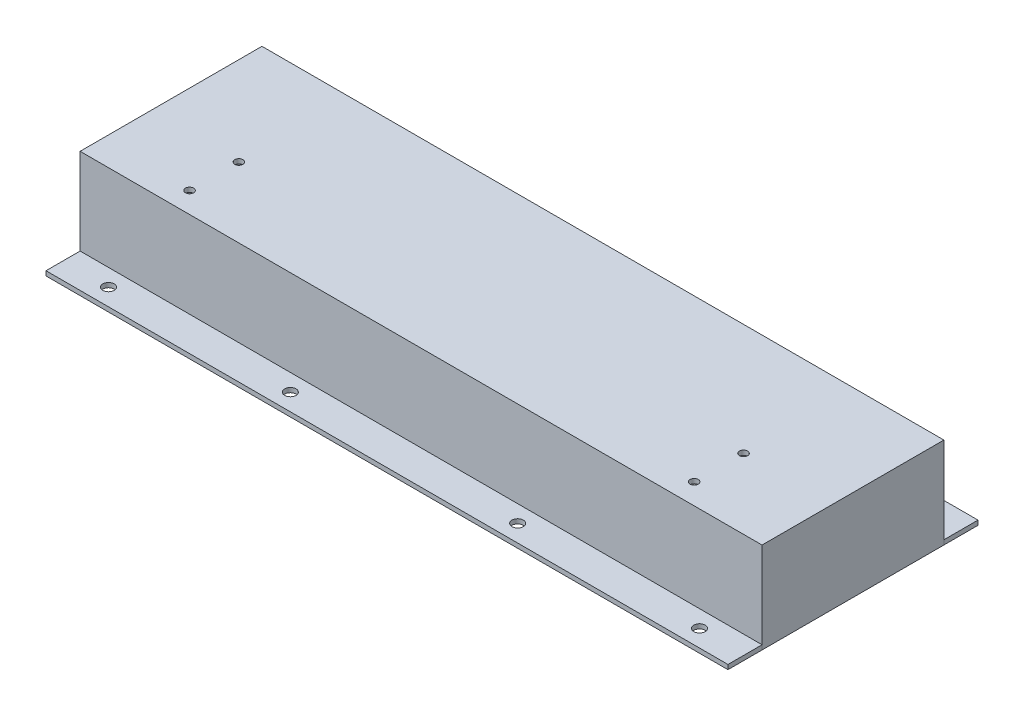
ISO-10303-21;
HEADER;
FILE_DESCRIPTION(('STEP AP214'),'2;1');
FILE_NAME('part.step','',(''),(''),'','','');
FILE_SCHEMA(('AUTOMOTIVE_DESIGN { 1 0 10303 214 1 1 1 1 }'));
ENDSEC;
DATA;
#1=APPLICATION_CONTEXT('core data for automotive mechanical design processes');
#2=APPLICATION_PROTOCOL_DEFINITION('international standard','automotive_design',2000,#1);
#3=PRODUCT_CONTEXT('',#1,'mechanical');
#4=PRODUCT('Part','Part','',(#3));
#5=PRODUCT_RELATED_PRODUCT_CATEGORY('part','',(#4));
#6=PRODUCT_DEFINITION_FORMATION('','',#4);
#7=PRODUCT_DEFINITION_CONTEXT('part definition',#1,'design');
#8=PRODUCT_DEFINITION('design','',#6,#7);
#9=PRODUCT_DEFINITION_SHAPE('','',#8);
#10=(LENGTH_UNIT() NAMED_UNIT(*) SI_UNIT(.MILLI.,.METRE.));
#11=(NAMED_UNIT(*) PLANE_ANGLE_UNIT() SI_UNIT($,.RADIAN.));
#12=(NAMED_UNIT(*) SI_UNIT($,.STERADIAN.) SOLID_ANGLE_UNIT());
#13=UNCERTAINTY_MEASURE_WITH_UNIT(LENGTH_MEASURE(1.E-05),#10,'distance_accuracy_value','');
#14=(GEOMETRIC_REPRESENTATION_CONTEXT(3) GLOBAL_UNCERTAINTY_ASSIGNED_CONTEXT((#13)) GLOBAL_UNIT_ASSIGNED_CONTEXT((#10,
#11,#12)) REPRESENTATION_CONTEXT('',''));
#15=CARTESIAN_POINT('',(0.,0.,0.));
#16=DIRECTION('',(0.,0.,1.));
#17=DIRECTION('',(1.,0.,0.));
#18=AXIS2_PLACEMENT_3D('',#15,#16,#17);
#19=CARTESIAN_POINT('',(-150.,2.,-40.));
#20=DIRECTION('',(-1.,0.,0.));
#21=DIRECTION('',(0.,0.,1.));
#22=AXIS2_PLACEMENT_3D('',#19,#20,#21);
#23=PLANE('',#22);
#24=DIRECTION('',(0.,0.,-1.));
#25=VECTOR('',#24,1.);
#26=CARTESIAN_POINT('',(-150.,0.,-40.));
#27=LINE('',#26,#25);
#28=CARTESIAN_POINT('',(-150.,0.,-40.));
#29=VERTEX_POINT('',#28);
#30=CARTESIAN_POINT('',(-150.,0.,-55.));
#31=VERTEX_POINT('',#30);
#32=EDGE_CURVE('E111',#29,#31,#27,.T.);
#33=ORIENTED_EDGE('',*,*,#32,.F.);
#34=DIRECTION('',(0.,-1.,0.));
#35=VECTOR('',#34,1.);
#36=CARTESIAN_POINT('',(-150.,2.,-40.));
#37=LINE('',#36,#35);
#38=CARTESIAN_POINT('',(-150.,2.,-40.));
#39=VERTEX_POINT('',#38);
#40=EDGE_CURVE('E12',#39,#29,#37,.T.);
#41=ORIENTED_EDGE('',*,*,#40,.F.);
#42=DIRECTION('',(0.,0.,-1.));
#43=VECTOR('',#42,1.);
#44=CARTESIAN_POINT('',(-150.,2.,-40.));
#45=LINE('',#44,#43);
#46=CARTESIAN_POINT('',(-150.,2.,-55.));
#47=VERTEX_POINT('',#46);
#48=EDGE_CURVE('E104',#39,#47,#45,.T.);
#49=ORIENTED_EDGE('',*,*,#48,.T.);
#50=DIRECTION('',(0.,-1.,0.));
#51=VECTOR('',#50,1.);
#52=CARTESIAN_POINT('',(-150.,2.,-55.));
#53=LINE('',#52,#51);
#54=EDGE_CURVE('E49',#47,#31,#53,.T.);
#55=ORIENTED_EDGE('',*,*,#54,.T.);
#56=EDGE_LOOP('',(#33,#41,#49,#55));
#57=FACE_BOUND('',#56,.T.);
#58=ADVANCED_FACE('F46',(#57),#23,.T.);
#59=CARTESIAN_POINT('',(-150.,2.,-40.));
#60=DIRECTION('',(0.,0.,1.));
#61=DIRECTION('',(1.,0.,0.));
#62=AXIS2_PLACEMENT_3D('',#59,#60,#61);
#63=PLANE('',#62);
#64=DIRECTION('',(-1.,0.,0.));
#65=VECTOR('',#64,1.);
#66=CARTESIAN_POINT('',(-150.,0.,-40.));
#67=LINE('',#66,#65);
#68=CARTESIAN_POINT('',(150.,0.,-40.));
#69=VERTEX_POINT('',#68);
#70=EDGE_CURVE('E106',#69,#29,#67,.T.);
#71=ORIENTED_EDGE('',*,*,#70,.F.);
#72=DIRECTION('',(0.,-1.,0.));
#73=VECTOR('',#72,1.);
#74=CARTESIAN_POINT('',(150.,2.,-40.));
#75=LINE('',#74,#73);
#76=CARTESIAN_POINT('',(150.,2.,-40.));
#77=VERTEX_POINT('',#76);
#78=EDGE_CURVE('E55',#77,#69,#75,.T.);
#79=ORIENTED_EDGE('',*,*,#78,.F.);
#80=DIRECTION('',(-1.,0.,0.));
#81=VECTOR('',#80,1.);
#82=CARTESIAN_POINT('',(-150.,2.,-40.));
#83=LINE('',#82,#81);
#84=EDGE_CURVE('E101',#77,#39,#83,.T.);
#85=ORIENTED_EDGE('',*,*,#84,.T.);
#86=ORIENTED_EDGE('',*,*,#40,.T.);
#87=EDGE_LOOP('',(#71,#79,#85,#86));
#88=FACE_BOUND('',#87,.T.);
#89=ADVANCED_FACE('F122',(#88),#63,.T.);
#90=CARTESIAN_POINT('',(150.,2.,-40.));
#91=DIRECTION('',(1.,0.,0.));
#92=DIRECTION('',(0.,0.,-1.));
#93=AXIS2_PLACEMENT_3D('',#90,#91,#92);
#94=PLANE('',#93);
#95=DIRECTION('',(0.,0.,1.));
#96=VECTOR('',#95,1.);
#97=CARTESIAN_POINT('',(150.,0.,-40.));
#98=LINE('',#97,#96);
#99=CARTESIAN_POINT('',(150.,0.,-55.));
#100=VERTEX_POINT('',#99);
#101=EDGE_CURVE('E96',#100,#69,#98,.T.);
#102=ORIENTED_EDGE('',*,*,#101,.F.);
#103=DIRECTION('',(0.,-1.,0.));
#104=VECTOR('',#103,1.);
#105=CARTESIAN_POINT('',(150.,2.,-55.));
#106=LINE('',#105,#104);
#107=CARTESIAN_POINT('',(150.,2.,-55.));
#108=VERTEX_POINT('',#107);
#109=EDGE_CURVE('E91',#108,#100,#106,.T.);
#110=ORIENTED_EDGE('',*,*,#109,.F.);
#111=DIRECTION('',(0.,0.,1.));
#112=VECTOR('',#111,1.);
#113=CARTESIAN_POINT('',(150.,2.,-40.));
#114=LINE('',#113,#112);
#115=EDGE_CURVE('E94',#108,#77,#114,.T.);
#116=ORIENTED_EDGE('',*,*,#115,.T.);
#117=ORIENTED_EDGE('',*,*,#78,.T.);
#118=EDGE_LOOP('',(#102,#110,#116,#117));
#119=FACE_BOUND('',#118,.T.);
#120=ADVANCED_FACE('F93',(#119),#94,.T.);
#121=CARTESIAN_POINT('',(-150.,2.,-55.));
#122=DIRECTION('',(0.,0.,-1.));
#123=DIRECTION('',(-1.,0.,0.));
#124=AXIS2_PLACEMENT_3D('',#121,#122,#123);
#125=PLANE('',#124);
#126=DIRECTION('',(1.,0.,0.));
#127=VECTOR('',#126,1.);
#128=CARTESIAN_POINT('',(-150.,0.,-55.));
#129=LINE('',#128,#127);
#130=EDGE_CURVE('E114',#31,#100,#129,.T.);
#131=ORIENTED_EDGE('',*,*,#130,.F.);
#132=ORIENTED_EDGE('',*,*,#54,.F.);
#133=DIRECTION('',(1.,0.,0.));
#134=VECTOR('',#133,1.);
#135=CARTESIAN_POINT('',(-150.,2.,-55.));
#136=LINE('',#135,#134);
#137=EDGE_CURVE('E100',#47,#108,#136,.T.);
#138=ORIENTED_EDGE('',*,*,#137,.T.);
#139=ORIENTED_EDGE('',*,*,#109,.T.);
#140=EDGE_LOOP('',(#131,#132,#138,#139));
#141=FACE_BOUND('',#140,.T.);
#142=ADVANCED_FACE('F103',(#141),#125,.T.);
#143=CARTESIAN_POINT('',(0.,2.,0.));
#144=DIRECTION('',(0.,-1.,0.));
#145=DIRECTION('',(0.,0.,-1.));
#146=AXIS2_PLACEMENT_3D('',#143,#144,#145);
#147=PLANE('',#146);
#148=CARTESIAN_POINT('',(130.,2.,-47.5));
#149=DIRECTION('',(0.,1.,0.));
#150=DIRECTION('',(0.,0.,1.));
#151=AXIS2_PLACEMENT_3D('',#148,#149,#150);
#152=CIRCLE('',#151,2.5);
#153=CARTESIAN_POINT('',(130.,2.,-45.));
#154=VERTEX_POINT('',#153);
#155=EDGE_CURVE('E165',#154,#154,#152,.T.);
#156=ORIENTED_EDGE('',*,*,#155,.F.);
#157=EDGE_LOOP('',(#156));
#158=FACE_BOUND('',#157,.T.);
#159=CARTESIAN_POINT('',(50.,2.,-47.5));
#160=DIRECTION('',(0.,1.,0.));
#161=DIRECTION('',(0.,0.,1.));
#162=AXIS2_PLACEMENT_3D('',#159,#160,#161);
#163=CIRCLE('',#162,2.50000000000001);
#164=CARTESIAN_POINT('',(50.,2.,-45.));
#165=VERTEX_POINT('',#164);
#166=EDGE_CURVE('E170',#165,#165,#163,.T.);
#167=ORIENTED_EDGE('',*,*,#166,.F.);
#168=EDGE_LOOP('',(#167));
#169=FACE_BOUND('',#168,.T.);
#170=CARTESIAN_POINT('',(-50.,2.,-47.5));
#171=DIRECTION('',(0.,1.,0.));
#172=DIRECTION('',(0.,0.,-1.));
#173=AXIS2_PLACEMENT_3D('',#170,#171,#172);
#174=CIRCLE('',#173,2.50000000000001);
#175=CARTESIAN_POINT('',(-50.,2.,-50.));
#176=VERTEX_POINT('',#175);
#177=EDGE_CURVE('E178',#176,#176,#174,.T.);
#178=ORIENTED_EDGE('',*,*,#177,.F.);
#179=EDGE_LOOP('',(#178));
#180=FACE_BOUND('',#179,.T.);
#181=CARTESIAN_POINT('',(-130.,2.,-47.5));
#182=DIRECTION('',(0.,1.,0.));
#183=DIRECTION('',(0.,0.,-1.));
#184=AXIS2_PLACEMENT_3D('',#181,#182,#183);
#185=CIRCLE('',#184,2.5);
#186=CARTESIAN_POINT('',(-130.,2.,-50.));
#187=VERTEX_POINT('',#186);
#188=EDGE_CURVE('E183',#187,#187,#185,.T.);
#189=ORIENTED_EDGE('',*,*,#188,.F.);
#190=EDGE_LOOP('',(#189));
#191=FACE_BOUND('',#190,.T.);
#192=ORIENTED_EDGE('',*,*,#48,.F.);
#193=ORIENTED_EDGE('',*,*,#84,.F.);
#194=ORIENTED_EDGE('',*,*,#115,.F.);
#195=ORIENTED_EDGE('',*,*,#137,.F.);
#196=EDGE_LOOP('',(#192,#193,#194,#195));
#197=FACE_BOUND('',#196,.T.);
#198=ADVANCED_FACE('F99',(#158,#169,#180,#191,#197),#147,.F.);
#199=CARTESIAN_POINT('',(0.,0.,0.));
#200=DIRECTION('',(0.,-1.,0.));
#201=DIRECTION('',(0.,0.,-1.));
#202=AXIS2_PLACEMENT_3D('',#199,#200,#201);
#203=PLANE('',#202);
#204=CARTESIAN_POINT('',(130.,0.,-47.5));
#205=DIRECTION('',(0.,1.,0.));
#206=DIRECTION('',(0.,0.,1.));
#207=AXIS2_PLACEMENT_3D('',#204,#205,#206);
#208=CIRCLE('',#207,2.5);
#209=CARTESIAN_POINT('',(130.,0.,-45.));
#210=VERTEX_POINT('',#209);
#211=EDGE_CURVE('E115',#210,#210,#208,.T.);
#212=ORIENTED_EDGE('',*,*,#211,.T.);
#213=EDGE_LOOP('',(#212));
#214=FACE_BOUND('',#213,.T.);
#215=CARTESIAN_POINT('',(50.,0.,-47.5));
#216=DIRECTION('',(0.,1.,0.));
#217=DIRECTION('',(0.,0.,1.));
#218=AXIS2_PLACEMENT_3D('',#215,#216,#217);
#219=CIRCLE('',#218,2.50000000000001);
#220=CARTESIAN_POINT('',(50.,0.,-45.));
#221=VERTEX_POINT('',#220);
#222=EDGE_CURVE('E166',#221,#221,#219,.T.);
#223=ORIENTED_EDGE('',*,*,#222,.T.);
#224=EDGE_LOOP('',(#223));
#225=FACE_BOUND('',#224,.T.);
#226=CARTESIAN_POINT('',(-50.,0.,-47.5));
#227=DIRECTION('',(0.,1.,0.));
#228=DIRECTION('',(0.,0.,-1.));
#229=AXIS2_PLACEMENT_3D('',#226,#227,#228);
#230=CIRCLE('',#229,2.50000000000001);
#231=CARTESIAN_POINT('',(-50.,0.,-50.));
#232=VERTEX_POINT('',#231);
#233=EDGE_CURVE('E175',#232,#232,#230,.T.);
#234=ORIENTED_EDGE('',*,*,#233,.T.);
#235=EDGE_LOOP('',(#234));
#236=FACE_BOUND('',#235,.T.);
#237=CARTESIAN_POINT('',(-130.,0.,-47.5));
#238=DIRECTION('',(0.,1.,0.));
#239=DIRECTION('',(0.,0.,-1.));
#240=AXIS2_PLACEMENT_3D('',#237,#238,#239);
#241=CIRCLE('',#240,2.5);
#242=CARTESIAN_POINT('',(-130.,0.,-50.));
#243=VERTEX_POINT('',#242);
#244=EDGE_CURVE('E181',#243,#243,#241,.T.);
#245=ORIENTED_EDGE('',*,*,#244,.T.);
#246=EDGE_LOOP('',(#245));
#247=FACE_BOUND('',#246,.T.);
#248=ORIENTED_EDGE('',*,*,#32,.T.);
#249=ORIENTED_EDGE('',*,*,#130,.T.);
#250=ORIENTED_EDGE('',*,*,#101,.T.);
#251=ORIENTED_EDGE('',*,*,#70,.T.);
#252=EDGE_LOOP('',(#248,#249,#250,#251));
#253=FACE_BOUND('',#252,.T.);
#254=ADVANCED_FACE('F121',(#214,#225,#236,#247,#253),#203,.T.);
#255=CARTESIAN_POINT('',(-130.,0.,-47.5));
#256=DIRECTION('',(0.,1.,0.));
#257=DIRECTION('',(0.,0.,1.));
#258=AXIS2_PLACEMENT_3D('',#255,#256,#257);
#259=CYLINDRICAL_SURFACE('',#258,2.5);
#260=ORIENTED_EDGE('',*,*,#244,.F.);
#261=EDGE_LOOP('',(#260));
#262=FACE_BOUND('',#261,.T.);
#263=ORIENTED_EDGE('',*,*,#188,.T.);
#264=EDGE_LOOP('',(#263));
#265=FACE_BOUND('',#264,.T.);
#266=ADVANCED_FACE('F140',(#262,#265),#259,.F.);
#267=CARTESIAN_POINT('',(-50.,0.,-47.5));
#268=DIRECTION('',(0.,1.,0.));
#269=DIRECTION('',(0.,0.,1.));
#270=AXIS2_PLACEMENT_3D('',#267,#268,#269);
#271=CYLINDRICAL_SURFACE('',#270,2.50000000000001);
#272=ORIENTED_EDGE('',*,*,#233,.F.);
#273=EDGE_LOOP('',(#272));
#274=FACE_BOUND('',#273,.T.);
#275=ORIENTED_EDGE('',*,*,#177,.T.);
#276=EDGE_LOOP('',(#275));
#277=FACE_BOUND('',#276,.T.);
#278=ADVANCED_FACE('F147',(#274,#277),#271,.F.);
#279=CARTESIAN_POINT('',(50.,0.,-47.5));
#280=DIRECTION('',(0.,1.,0.));
#281=DIRECTION('',(0.,0.,1.));
#282=AXIS2_PLACEMENT_3D('',#279,#280,#281);
#283=CYLINDRICAL_SURFACE('',#282,2.50000000000001);
#284=ORIENTED_EDGE('',*,*,#222,.F.);
#285=EDGE_LOOP('',(#284));
#286=FACE_BOUND('',#285,.T.);
#287=ORIENTED_EDGE('',*,*,#166,.T.);
#288=EDGE_LOOP('',(#287));
#289=FACE_BOUND('',#288,.T.);
#290=ADVANCED_FACE('F151',(#286,#289),#283,.F.);
#291=CARTESIAN_POINT('',(130.,0.,-47.5));
#292=DIRECTION('',(0.,1.,0.));
#293=DIRECTION('',(0.,0.,1.));
#294=AXIS2_PLACEMENT_3D('',#291,#292,#293);
#295=CYLINDRICAL_SURFACE('',#294,2.5);
#296=ORIENTED_EDGE('',*,*,#211,.F.);
#297=EDGE_LOOP('',(#296));
#298=FACE_BOUND('',#297,.T.);
#299=ORIENTED_EDGE('',*,*,#155,.T.);
#300=EDGE_LOOP('',(#299));
#301=FACE_BOUND('',#300,.T.);
#302=ADVANCED_FACE('F155',(#298,#301),#295,.F.);
#303=CLOSED_SHELL('',(#58,#89,#120,#142,#198,#254,#266,#278,#290,#302));
#304=MANIFOLD_SOLID_BREP('B2',#303);
#305=CARTESIAN_POINT('',(-150.,2.,40.));
#306=DIRECTION('',(-1.,0.,0.));
#307=DIRECTION('',(0.,0.,1.));
#308=AXIS2_PLACEMENT_3D('',#305,#306,#307);
#309=PLANE('',#308);
#310=DIRECTION('',(0.,0.,-1.));
#311=VECTOR('',#310,1.);
#312=CARTESIAN_POINT('',(-150.,0.,40.));
#313=LINE('',#312,#311);
#314=CARTESIAN_POINT('',(-150.,0.,55.));
#315=VERTEX_POINT('',#314);
#316=CARTESIAN_POINT('',(-150.,0.,40.));
#317=VERTEX_POINT('',#316);
#318=EDGE_CURVE('E328',#315,#317,#313,.T.);
#319=ORIENTED_EDGE('',*,*,#318,.F.);
#320=DIRECTION('',(0.,-1.,0.));
#321=VECTOR('',#320,1.);
#322=CARTESIAN_POINT('',(-150.,2.,55.));
#323=LINE('',#322,#321);
#324=CARTESIAN_POINT('',(-150.,2.,55.));
#325=VERTEX_POINT('',#324);
#326=EDGE_CURVE('E44',#325,#315,#323,.T.);
#327=ORIENTED_EDGE('',*,*,#326,.F.);
#328=DIRECTION('',(0.,0.,-1.));
#329=VECTOR('',#328,1.);
#330=CARTESIAN_POINT('',(-150.,2.,40.));
#331=LINE('',#330,#329);
#332=CARTESIAN_POINT('',(-150.,2.,40.));
#333=VERTEX_POINT('',#332);
#334=EDGE_CURVE('E321',#325,#333,#331,.T.);
#335=ORIENTED_EDGE('',*,*,#334,.T.);
#336=DIRECTION('',(0.,-1.,0.));
#337=VECTOR('',#336,1.);
#338=CARTESIAN_POINT('',(-150.,2.,40.));
#339=LINE('',#338,#337);
#340=EDGE_CURVE('E266',#333,#317,#339,.T.);
#341=ORIENTED_EDGE('',*,*,#340,.T.);
#342=EDGE_LOOP('',(#319,#327,#335,#341));
#343=FACE_BOUND('',#342,.T.);
#344=ADVANCED_FACE('F263',(#343),#309,.T.);
#345=CARTESIAN_POINT('',(-150.,2.,55.));
#346=DIRECTION('',(0.,0.,1.));
#347=DIRECTION('',(1.,0.,0.));
#348=AXIS2_PLACEMENT_3D('',#345,#346,#347);
#349=PLANE('',#348);
#350=DIRECTION('',(-1.,0.,0.));
#351=VECTOR('',#350,1.);
#352=CARTESIAN_POINT('',(-150.,0.,55.));
#353=LINE('',#352,#351);
#354=CARTESIAN_POINT('',(150.,0.,55.));
#355=VERTEX_POINT('',#354);
#356=EDGE_CURVE('E323',#355,#315,#353,.T.);
#357=ORIENTED_EDGE('',*,*,#356,.F.);
#358=DIRECTION('',(0.,-1.,0.));
#359=VECTOR('',#358,1.);
#360=CARTESIAN_POINT('',(150.,2.,55.));
#361=LINE('',#360,#359);
#362=CARTESIAN_POINT('',(150.,2.,55.));
#363=VERTEX_POINT('',#362);
#364=EDGE_CURVE('E272',#363,#355,#361,.T.);
#365=ORIENTED_EDGE('',*,*,#364,.F.);
#366=DIRECTION('',(-1.,0.,0.));
#367=VECTOR('',#366,1.);
#368=CARTESIAN_POINT('',(-150.,2.,55.));
#369=LINE('',#368,#367);
#370=EDGE_CURVE('E318',#363,#325,#369,.T.);
#371=ORIENTED_EDGE('',*,*,#370,.T.);
#372=ORIENTED_EDGE('',*,*,#326,.T.);
#373=EDGE_LOOP('',(#357,#365,#371,#372));
#374=FACE_BOUND('',#373,.T.);
#375=ADVANCED_FACE('F339',(#374),#349,.T.);
#376=CARTESIAN_POINT('',(150.,2.,40.));
#377=DIRECTION('',(1.,0.,0.));
#378=DIRECTION('',(0.,0.,-1.));
#379=AXIS2_PLACEMENT_3D('',#376,#377,#378);
#380=PLANE('',#379);
#381=DIRECTION('',(0.,0.,1.));
#382=VECTOR('',#381,1.);
#383=CARTESIAN_POINT('',(150.,0.,40.));
#384=LINE('',#383,#382);
#385=CARTESIAN_POINT('',(150.,0.,40.));
#386=VERTEX_POINT('',#385);
#387=EDGE_CURVE('E313',#386,#355,#384,.T.);
#388=ORIENTED_EDGE('',*,*,#387,.F.);
#389=DIRECTION('',(0.,-1.,0.));
#390=VECTOR('',#389,1.);
#391=CARTESIAN_POINT('',(150.,2.,40.));
#392=LINE('',#391,#390);
#393=CARTESIAN_POINT('',(150.,2.,40.));
#394=VERTEX_POINT('',#393);
#395=EDGE_CURVE('E308',#394,#386,#392,.T.);
#396=ORIENTED_EDGE('',*,*,#395,.F.);
#397=DIRECTION('',(0.,0.,1.));
#398=VECTOR('',#397,1.);
#399=CARTESIAN_POINT('',(150.,2.,40.));
#400=LINE('',#399,#398);
#401=EDGE_CURVE('E311',#394,#363,#400,.T.);
#402=ORIENTED_EDGE('',*,*,#401,.T.);
#403=ORIENTED_EDGE('',*,*,#364,.T.);
#404=EDGE_LOOP('',(#388,#396,#402,#403));
#405=FACE_BOUND('',#404,.T.);
#406=ADVANCED_FACE('F310',(#405),#380,.T.);
#407=CARTESIAN_POINT('',(-150.,2.,40.));
#408=DIRECTION('',(0.,0.,-1.));
#409=DIRECTION('',(-1.,0.,0.));
#410=AXIS2_PLACEMENT_3D('',#407,#408,#409);
#411=PLANE('',#410);
#412=DIRECTION('',(1.,0.,0.));
#413=VECTOR('',#412,1.);
#414=CARTESIAN_POINT('',(-150.,0.,40.));
#415=LINE('',#414,#413);
#416=EDGE_CURVE('E331',#317,#386,#415,.T.);
#417=ORIENTED_EDGE('',*,*,#416,.F.);
#418=ORIENTED_EDGE('',*,*,#340,.F.);
#419=DIRECTION('',(1.,0.,0.));
#420=VECTOR('',#419,1.);
#421=CARTESIAN_POINT('',(-150.,2.,40.));
#422=LINE('',#421,#420);
#423=EDGE_CURVE('E317',#333,#394,#422,.T.);
#424=ORIENTED_EDGE('',*,*,#423,.T.);
#425=ORIENTED_EDGE('',*,*,#395,.T.);
#426=EDGE_LOOP('',(#417,#418,#424,#425));
#427=FACE_BOUND('',#426,.T.);
#428=ADVANCED_FACE('F320',(#427),#411,.T.);
#429=CARTESIAN_POINT('',(0.,2.,0.));
#430=DIRECTION('',(0.,1.,0.));
#431=DIRECTION('',(0.,0.,1.));
#432=AXIS2_PLACEMENT_3D('',#429,#430,#431);
#433=PLANE('',#432);
#434=CARTESIAN_POINT('',(-130.,2.,47.5));
#435=DIRECTION('',(0.,1.,0.));
#436=DIRECTION('',(0.,0.,1.));
#437=AXIS2_PLACEMENT_3D('',#434,#435,#436);
#438=CIRCLE('',#437,2.5);
#439=CARTESIAN_POINT('',(-130.,2.,50.));
#440=VERTEX_POINT('',#439);
#441=EDGE_CURVE('E382',#440,#440,#438,.T.);
#442=ORIENTED_EDGE('',*,*,#441,.F.);
#443=EDGE_LOOP('',(#442));
#444=FACE_BOUND('',#443,.T.);
#445=CARTESIAN_POINT('',(-50.,2.,47.5));
#446=DIRECTION('',(0.,1.,0.));
#447=DIRECTION('',(0.,0.,1.));
#448=AXIS2_PLACEMENT_3D('',#445,#446,#447);
#449=CIRCLE('',#448,2.50000000000001);
#450=CARTESIAN_POINT('',(-50.,2.,50.));
#451=VERTEX_POINT('',#450);
#452=EDGE_CURVE('E387',#451,#451,#449,.T.);
#453=ORIENTED_EDGE('',*,*,#452,.F.);
#454=EDGE_LOOP('',(#453));
#455=FACE_BOUND('',#454,.T.);
#456=CARTESIAN_POINT('',(50.,2.,47.5));
#457=DIRECTION('',(0.,1.,0.));
#458=DIRECTION('',(0.,0.,-1.));
#459=AXIS2_PLACEMENT_3D('',#456,#457,#458);
#460=CIRCLE('',#459,2.50000000000001);
#461=CARTESIAN_POINT('',(50.,2.,45.));
#462=VERTEX_POINT('',#461);
#463=EDGE_CURVE('E395',#462,#462,#460,.T.);
#464=ORIENTED_EDGE('',*,*,#463,.F.);
#465=EDGE_LOOP('',(#464));
#466=FACE_BOUND('',#465,.T.);
#467=CARTESIAN_POINT('',(130.,2.,47.5));
#468=DIRECTION('',(0.,1.,0.));
#469=DIRECTION('',(0.,0.,-1.));
#470=AXIS2_PLACEMENT_3D('',#467,#468,#469);
#471=CIRCLE('',#470,2.5);
#472=CARTESIAN_POINT('',(130.,2.,45.));
#473=VERTEX_POINT('',#472);
#474=EDGE_CURVE('E400',#473,#473,#471,.T.);
#475=ORIENTED_EDGE('',*,*,#474,.F.);
#476=EDGE_LOOP('',(#475));
#477=FACE_BOUND('',#476,.T.);
#478=ORIENTED_EDGE('',*,*,#334,.F.);
#479=ORIENTED_EDGE('',*,*,#370,.F.);
#480=ORIENTED_EDGE('',*,*,#401,.F.);
#481=ORIENTED_EDGE('',*,*,#423,.F.);
#482=EDGE_LOOP('',(#478,#479,#480,#481));
#483=FACE_BOUND('',#482,.T.);
#484=ADVANCED_FACE('F316',(#444,#455,#466,#477,#483),#433,.T.);
#485=CARTESIAN_POINT('',(0.,0.,0.));
#486=DIRECTION('',(0.,1.,0.));
#487=DIRECTION('',(0.,0.,1.));
#488=AXIS2_PLACEMENT_3D('',#485,#486,#487);
#489=PLANE('',#488);
#490=CARTESIAN_POINT('',(-130.,0.,47.5));
#491=DIRECTION('',(0.,1.,0.));
#492=DIRECTION('',(0.,0.,1.));
#493=AXIS2_PLACEMENT_3D('',#490,#491,#492);
#494=CIRCLE('',#493,2.5);
#495=CARTESIAN_POINT('',(-130.,0.,50.));
#496=VERTEX_POINT('',#495);
#497=EDGE_CURVE('E332',#496,#496,#494,.T.);
#498=ORIENTED_EDGE('',*,*,#497,.T.);
#499=EDGE_LOOP('',(#498));
#500=FACE_BOUND('',#499,.T.);
#501=CARTESIAN_POINT('',(-50.,0.,47.5));
#502=DIRECTION('',(0.,1.,0.));
#503=DIRECTION('',(0.,0.,1.));
#504=AXIS2_PLACEMENT_3D('',#501,#502,#503);
#505=CIRCLE('',#504,2.50000000000001);
#506=CARTESIAN_POINT('',(-50.,0.,50.));
#507=VERTEX_POINT('',#506);
#508=EDGE_CURVE('E383',#507,#507,#505,.T.);
#509=ORIENTED_EDGE('',*,*,#508,.T.);
#510=EDGE_LOOP('',(#509));
#511=FACE_BOUND('',#510,.T.);
#512=CARTESIAN_POINT('',(50.,0.,47.5));
#513=DIRECTION('',(0.,1.,0.));
#514=DIRECTION('',(0.,0.,-1.));
#515=AXIS2_PLACEMENT_3D('',#512,#513,#514);
#516=CIRCLE('',#515,2.50000000000001);
#517=CARTESIAN_POINT('',(50.,0.,45.));
#518=VERTEX_POINT('',#517);
#519=EDGE_CURVE('E392',#518,#518,#516,.T.);
#520=ORIENTED_EDGE('',*,*,#519,.T.);
#521=EDGE_LOOP('',(#520));
#522=FACE_BOUND('',#521,.T.);
#523=CARTESIAN_POINT('',(130.,0.,47.5));
#524=DIRECTION('',(0.,1.,0.));
#525=DIRECTION('',(0.,0.,-1.));
#526=AXIS2_PLACEMENT_3D('',#523,#524,#525);
#527=CIRCLE('',#526,2.5);
#528=CARTESIAN_POINT('',(130.,0.,45.));
#529=VERTEX_POINT('',#528);
#530=EDGE_CURVE('E398',#529,#529,#527,.T.);
#531=ORIENTED_EDGE('',*,*,#530,.T.);
#532=EDGE_LOOP('',(#531));
#533=FACE_BOUND('',#532,.T.);
#534=ORIENTED_EDGE('',*,*,#318,.T.);
#535=ORIENTED_EDGE('',*,*,#416,.T.);
#536=ORIENTED_EDGE('',*,*,#387,.T.);
#537=ORIENTED_EDGE('',*,*,#356,.T.);
#538=EDGE_LOOP('',(#534,#535,#536,#537));
#539=FACE_BOUND('',#538,.T.);
#540=ADVANCED_FACE('F338',(#500,#511,#522,#533,#539),#489,.F.);
#541=CARTESIAN_POINT('',(130.,0.,47.5));
#542=DIRECTION('',(0.,1.,0.));
#543=DIRECTION('',(0.,0.,1.));
#544=AXIS2_PLACEMENT_3D('',#541,#542,#543);
#545=CYLINDRICAL_SURFACE('',#544,2.5);
#546=ORIENTED_EDGE('',*,*,#530,.F.);
#547=EDGE_LOOP('',(#546));
#548=FACE_BOUND('',#547,.T.);
#549=ORIENTED_EDGE('',*,*,#474,.T.);
#550=EDGE_LOOP('',(#549));
#551=FACE_BOUND('',#550,.T.);
#552=ADVANCED_FACE('F357',(#548,#551),#545,.F.);
#553=CARTESIAN_POINT('',(50.,0.,47.5));
#554=DIRECTION('',(0.,1.,0.));
#555=DIRECTION('',(0.,0.,1.));
#556=AXIS2_PLACEMENT_3D('',#553,#554,#555);
#557=CYLINDRICAL_SURFACE('',#556,2.50000000000001);
#558=ORIENTED_EDGE('',*,*,#519,.F.);
#559=EDGE_LOOP('',(#558));
#560=FACE_BOUND('',#559,.T.);
#561=ORIENTED_EDGE('',*,*,#463,.T.);
#562=EDGE_LOOP('',(#561));
#563=FACE_BOUND('',#562,.T.);
#564=ADVANCED_FACE('F364',(#560,#563),#557,.F.);
#565=CARTESIAN_POINT('',(-50.,0.,47.5));
#566=DIRECTION('',(0.,1.,0.));
#567=DIRECTION('',(0.,0.,1.));
#568=AXIS2_PLACEMENT_3D('',#565,#566,#567);
#569=CYLINDRICAL_SURFACE('',#568,2.50000000000001);
#570=ORIENTED_EDGE('',*,*,#508,.F.);
#571=EDGE_LOOP('',(#570));
#572=FACE_BOUND('',#571,.T.);
#573=ORIENTED_EDGE('',*,*,#452,.T.);
#574=EDGE_LOOP('',(#573));
#575=FACE_BOUND('',#574,.T.);
#576=ADVANCED_FACE('F368',(#572,#575),#569,.F.);
#577=CARTESIAN_POINT('',(-130.,0.,47.5));
#578=DIRECTION('',(0.,1.,0.));
#579=DIRECTION('',(0.,0.,1.));
#580=AXIS2_PLACEMENT_3D('',#577,#578,#579);
#581=CYLINDRICAL_SURFACE('',#580,2.5);
#582=ORIENTED_EDGE('',*,*,#497,.F.);
#583=EDGE_LOOP('',(#582));
#584=FACE_BOUND('',#583,.T.);
#585=ORIENTED_EDGE('',*,*,#441,.T.);
#586=EDGE_LOOP('',(#585));
#587=FACE_BOUND('',#586,.T.);
#588=ADVANCED_FACE('F372',(#584,#587),#581,.F.);
#589=CLOSED_SHELL('',(#344,#375,#406,#428,#484,#540,#552,#564,#576,#588));
#590=MANIFOLD_SOLID_BREP('B6',#589);
#591=CARTESIAN_POINT('',(-150.,40.,40.));
#592=DIRECTION('',(1.,0.,0.));
#593=DIRECTION('',(0.,0.,-1.));
#594=AXIS2_PLACEMENT_3D('',#591,#592,#593);
#595=PLANE('',#594);
#596=DIRECTION('',(0.,0.,1.));
#597=VECTOR('',#596,1.);
#598=CARTESIAN_POINT('',(-150.,0.,40.));
#599=LINE('',#598,#597);
#600=CARTESIAN_POINT('',(-150.,0.,-40.));
#601=VERTEX_POINT('',#600);
#602=CARTESIAN_POINT('',(-150.,0.,40.));
#603=VERTEX_POINT('',#602);
#604=EDGE_CURVE('E645',#601,#603,#599,.T.);
#605=ORIENTED_EDGE('',*,*,#604,.T.);
#606=DIRECTION('',(0.,-1.,0.));
#607=VECTOR('',#606,1.);
#608=CARTESIAN_POINT('',(-150.,40.,40.));
#609=LINE('',#608,#607);
#610=CARTESIAN_POINT('',(-150.,40.,40.));
#611=VERTEX_POINT('',#610);
#612=EDGE_CURVE('E261',#611,#603,#609,.T.);
#613=ORIENTED_EDGE('',*,*,#612,.F.);
#614=DIRECTION('',(0.,0.,1.));
#615=VECTOR('',#614,1.);
#616=CARTESIAN_POINT('',(-150.,40.,40.));
#617=LINE('',#616,#615);
#618=CARTESIAN_POINT('',(-150.,40.,-40.));
#619=VERTEX_POINT('',#618);
#620=EDGE_CURVE('E652',#619,#611,#617,.T.);
#621=ORIENTED_EDGE('',*,*,#620,.F.);
#622=DIRECTION('',(0.,-1.,0.));
#623=VECTOR('',#622,1.);
#624=CARTESIAN_POINT('',(-150.,40.,-40.));
#625=LINE('',#624,#623);
#626=EDGE_CURVE('E662',#619,#601,#625,.T.);
#627=ORIENTED_EDGE('',*,*,#626,.T.);
#628=EDGE_LOOP('',(#605,#613,#621,#627));
#629=FACE_BOUND('',#628,.T.);
#630=ADVANCED_FACE('F471',(#629),#595,.F.);
#631=CARTESIAN_POINT('',(150.,40.,40.));
#632=DIRECTION('',(0.,0.,-1.));
#633=DIRECTION('',(-1.,0.,0.));
#634=AXIS2_PLACEMENT_3D('',#631,#632,#633);
#635=PLANE('',#634);
#636=DIRECTION('',(1.,0.,0.));
#637=VECTOR('',#636,1.);
#638=CARTESIAN_POINT('',(150.,0.,40.));
#639=LINE('',#638,#637);
#640=CARTESIAN_POINT('',(150.,0.,40.));
#641=VERTEX_POINT('',#640);
#642=EDGE_CURVE('E665',#603,#641,#639,.T.);
#643=ORIENTED_EDGE('',*,*,#642,.T.);
#644=DIRECTION('',(0.,-1.,0.));
#645=VECTOR('',#644,1.);
#646=CARTESIAN_POINT('',(150.,40.,40.));
#647=LINE('',#646,#645);
#648=CARTESIAN_POINT('',(150.,40.,40.));
#649=VERTEX_POINT('',#648);
#650=EDGE_CURVE('E478',#649,#641,#647,.T.);
#651=ORIENTED_EDGE('',*,*,#650,.F.);
#652=DIRECTION('',(1.,0.,0.));
#653=VECTOR('',#652,1.);
#654=CARTESIAN_POINT('',(150.,40.,40.));
#655=LINE('',#654,#653);
#656=EDGE_CURVE('E655',#611,#649,#655,.T.);
#657=ORIENTED_EDGE('',*,*,#656,.F.);
#658=ORIENTED_EDGE('',*,*,#612,.T.);
#659=EDGE_LOOP('',(#643,#651,#657,#658));
#660=FACE_BOUND('',#659,.T.);
#661=ADVANCED_FACE('F695',(#660),#635,.F.);
#662=CARTESIAN_POINT('',(150.,40.,40.));
#663=DIRECTION('',(-1.,0.,0.));
#664=DIRECTION('',(0.,0.,1.));
#665=AXIS2_PLACEMENT_3D('',#662,#663,#664);
#666=PLANE('',#665);
#667=DIRECTION('',(0.,0.,-1.));
#668=VECTOR('',#667,1.);
#669=CARTESIAN_POINT('',(150.,0.,40.));
#670=LINE('',#669,#668);
#671=CARTESIAN_POINT('',(150.,0.,-40.));
#672=VERTEX_POINT('',#671);
#673=EDGE_CURVE('E667',#641,#672,#670,.T.);
#674=ORIENTED_EDGE('',*,*,#673,.T.);
#675=DIRECTION('',(0.,-1.,0.));
#676=VECTOR('',#675,1.);
#677=CARTESIAN_POINT('',(150.,40.,-40.));
#678=LINE('',#677,#676);
#679=CARTESIAN_POINT('',(150.,40.,-40.));
#680=VERTEX_POINT('',#679);
#681=EDGE_CURVE('E672',#680,#672,#678,.T.);
#682=ORIENTED_EDGE('',*,*,#681,.F.);
#683=DIRECTION('',(0.,0.,-1.));
#684=VECTOR('',#683,1.);
#685=CARTESIAN_POINT('',(150.,40.,40.));
#686=LINE('',#685,#684);
#687=EDGE_CURVE('E658',#649,#680,#686,.T.);
#688=ORIENTED_EDGE('',*,*,#687,.F.);
#689=ORIENTED_EDGE('',*,*,#650,.T.);
#690=EDGE_LOOP('',(#674,#682,#688,#689));
#691=FACE_BOUND('',#690,.T.);
#692=ADVANCED_FACE('F679',(#691),#666,.F.);
#693=CARTESIAN_POINT('',(150.,40.,-40.));
#694=DIRECTION('',(0.,0.,1.));
#695=DIRECTION('',(1.,0.,0.));
#696=AXIS2_PLACEMENT_3D('',#693,#694,#695);
#697=PLANE('',#696);
#698=DIRECTION('',(-1.,0.,0.));
#699=VECTOR('',#698,1.);
#700=CARTESIAN_POINT('',(-89.25,8.75,-40.));
#701=LINE('',#700,#699);
#702=CARTESIAN_POINT('',(-60.75,8.75,-40.));
#703=VERTEX_POINT('',#702);
#704=CARTESIAN_POINT('',(-89.25,8.75,-40.));
#705=VERTEX_POINT('',#704);
#706=EDGE_CURVE('E586',#703,#705,#701,.T.);
#707=ORIENTED_EDGE('',*,*,#706,.F.);
#708=DIRECTION('',(0.,-1.,0.));
#709=VECTOR('',#708,1.);
#710=CARTESIAN_POINT('',(-60.75,8.75,-40.));
#711=LINE('',#710,#709);
#712=CARTESIAN_POINT('',(-60.75,31.25,-40.));
#713=VERTEX_POINT('',#712);
#714=EDGE_CURVE('E485',#713,#703,#711,.T.);
#715=ORIENTED_EDGE('',*,*,#714,.F.);
#716=DIRECTION('',(1.,0.,0.));
#717=VECTOR('',#716,1.);
#718=CARTESIAN_POINT('',(-89.25,31.25,-40.));
#719=LINE('',#718,#717);
#720=CARTESIAN_POINT('',(-89.25,31.25,-40.));
#721=VERTEX_POINT('',#720);
#722=EDGE_CURVE('E577',#721,#713,#719,.T.);
#723=ORIENTED_EDGE('',*,*,#722,.F.);
#724=DIRECTION('',(0.,1.,0.));
#725=VECTOR('',#724,1.);
#726=CARTESIAN_POINT('',(-89.25,8.75,-40.));
#727=LINE('',#726,#725);
#728=EDGE_CURVE('E580',#705,#721,#727,.T.);
#729=ORIENTED_EDGE('',*,*,#728,.F.);
#730=EDGE_LOOP('',(#707,#715,#723,#729));
#731=FACE_BOUND('',#730,.T.);
#732=DIRECTION('',(-1.,0.,0.));
#733=VECTOR('',#732,1.);
#734=CARTESIAN_POINT('',(150.,0.,-40.));
#735=LINE('',#734,#733);
#736=EDGE_CURVE('E656',#672,#601,#735,.T.);
#737=ORIENTED_EDGE('',*,*,#736,.T.);
#738=ORIENTED_EDGE('',*,*,#626,.F.);
#739=DIRECTION('',(-1.,0.,0.));
#740=VECTOR('',#739,1.);
#741=CARTESIAN_POINT('',(150.,40.,-40.));
#742=LINE('',#741,#740);
#743=EDGE_CURVE('E660',#680,#619,#742,.T.);
#744=ORIENTED_EDGE('',*,*,#743,.F.);
#745=ORIENTED_EDGE('',*,*,#681,.T.);
#746=EDGE_LOOP('',(#737,#738,#744,#745));
#747=FACE_BOUND('',#746,.T.);
#748=ADVANCED_FACE('F688',(#731,#747),#697,.F.);
#749=CARTESIAN_POINT('',(0.,40.,0.));
#750=DIRECTION('',(0.,1.,0.));
#751=DIRECTION('',(0.,0.,1.));
#752=AXIS2_PLACEMENT_3D('',#749,#750,#751);
#753=PLANE('',#752);
#754=CARTESIAN_POINT('',(-111.,40.,30.85));
#755=DIRECTION('',(0.,1.,0.));
#756=DIRECTION('',(0.,0.,-1.));
#757=AXIS2_PLACEMENT_3D('',#754,#755,#756);
#758=CIRCLE('',#757,1.79999999999999);
#759=CARTESIAN_POINT('',(-111.,40.,29.05));
#760=VERTEX_POINT('',#759);
#761=EDGE_CURVE('E592',#760,#760,#758,.T.);
#762=ORIENTED_EDGE('',*,*,#761,.F.);
#763=EDGE_LOOP('',(#762));
#764=FACE_BOUND('',#763,.T.);
#765=CARTESIAN_POINT('',(111.,40.,30.85));
#766=DIRECTION('',(0.,1.,0.));
#767=DIRECTION('',(0.,0.,1.));
#768=AXIS2_PLACEMENT_3D('',#765,#766,#767);
#769=CIRCLE('',#768,1.79999999999999);
#770=CARTESIAN_POINT('',(111.,40.,32.65));
#771=VERTEX_POINT('',#770);
#772=EDGE_CURVE('E606',#771,#771,#769,.T.);
#773=ORIENTED_EDGE('',*,*,#772,.F.);
#774=EDGE_LOOP('',(#773));
#775=FACE_BOUND('',#774,.T.);
#776=CARTESIAN_POINT('',(111.,40.,9.14999999999999));
#777=DIRECTION('',(0.,1.,0.));
#778=DIRECTION('',(0.,0.,-1.));
#779=AXIS2_PLACEMENT_3D('',#776,#777,#778);
#780=CIRCLE('',#779,1.79999999999999);
#781=CARTESIAN_POINT('',(111.,40.,7.35));
#782=VERTEX_POINT('',#781);
#783=EDGE_CURVE('E600',#782,#782,#780,.T.);
#784=ORIENTED_EDGE('',*,*,#783,.F.);
#785=EDGE_LOOP('',(#784));
#786=FACE_BOUND('',#785,.T.);
#787=CARTESIAN_POINT('',(-111.,40.,9.14999999999999));
#788=DIRECTION('',(0.,1.,0.));
#789=DIRECTION('',(0.,0.,1.));
#790=AXIS2_PLACEMENT_3D('',#787,#788,#789);
#791=CIRCLE('',#790,1.79999999999999);
#792=CARTESIAN_POINT('',(-111.,40.,10.95));
#793=VERTEX_POINT('',#792);
#794=EDGE_CURVE('E599',#793,#793,#791,.T.);
#795=ORIENTED_EDGE('',*,*,#794,.F.);
#796=EDGE_LOOP('',(#795));
#797=FACE_BOUND('',#796,.T.);
#798=ORIENTED_EDGE('',*,*,#620,.T.);
#799=ORIENTED_EDGE('',*,*,#656,.T.);
#800=ORIENTED_EDGE('',*,*,#687,.T.);
#801=ORIENTED_EDGE('',*,*,#743,.T.);
#802=EDGE_LOOP('',(#798,#799,#800,#801));
#803=FACE_BOUND('',#802,.T.);
#804=ADVANCED_FACE('F694',(#764,#775,#786,#797,#803),#753,.T.);
#805=CARTESIAN_POINT('',(0.,0.,0.));
#806=DIRECTION('',(0.,1.,0.));
#807=DIRECTION('',(0.,0.,1.));
#808=AXIS2_PLACEMENT_3D('',#805,#806,#807);
#809=PLANE('',#808);
#810=DIRECTION('',(1.,0.,0.));
#811=VECTOR('',#810,1.);
#812=CARTESIAN_POINT('',(148.,0.,-38.));
#813=LINE('',#812,#811);
#814=CARTESIAN_POINT('',(-148.,0.,-38.));
#815=VERTEX_POINT('',#814);
#816=CARTESIAN_POINT('',(148.,0.,-38.));
#817=VERTEX_POINT('',#816);
#818=EDGE_CURVE('E635',#815,#817,#813,.T.);
#819=ORIENTED_EDGE('',*,*,#818,.F.);
#820=DIRECTION('',(0.,0.,-1.));
#821=VECTOR('',#820,1.);
#822=CARTESIAN_POINT('',(-148.,0.,-38.));
#823=LINE('',#822,#821);
#824=CARTESIAN_POINT('',(-148.,0.,38.));
#825=VERTEX_POINT('',#824);
#826=EDGE_CURVE('E617',#825,#815,#823,.T.);
#827=ORIENTED_EDGE('',*,*,#826,.F.);
#828=DIRECTION('',(-1.,0.,0.));
#829=VECTOR('',#828,1.);
#830=CARTESIAN_POINT('',(148.,0.,38.));
#831=LINE('',#830,#829);
#832=CARTESIAN_POINT('',(148.,0.,38.));
#833=VERTEX_POINT('',#832);
#834=EDGE_CURVE('E624',#833,#825,#831,.T.);
#835=ORIENTED_EDGE('',*,*,#834,.F.);
#836=DIRECTION('',(0.,0.,1.));
#837=VECTOR('',#836,1.);
#838=CARTESIAN_POINT('',(148.,0.,-38.));
#839=LINE('',#838,#837);
#840=EDGE_CURVE('E638',#817,#833,#839,.T.);
#841=ORIENTED_EDGE('',*,*,#840,.F.);
#842=EDGE_LOOP('',(#819,#827,#835,#841));
#843=FACE_BOUND('',#842,.T.);
#844=ORIENTED_EDGE('',*,*,#604,.F.);
#845=ORIENTED_EDGE('',*,*,#736,.F.);
#846=ORIENTED_EDGE('',*,*,#673,.F.);
#847=ORIENTED_EDGE('',*,*,#642,.F.);
#848=EDGE_LOOP('',(#844,#845,#846,#847));
#849=FACE_BOUND('',#848,.T.);
#850=ADVANCED_FACE('F685',(#843,#849),#809,.F.);
#851=CARTESIAN_POINT('',(-148.,38.,-38.));
#852=DIRECTION('',(-1.,0.,0.));
#853=DIRECTION('',(0.,0.,1.));
#854=AXIS2_PLACEMENT_3D('',#851,#852,#853);
#855=PLANE('',#854);
#856=ORIENTED_EDGE('',*,*,#826,.T.);
#857=DIRECTION('',(0.,-1.,0.));
#858=VECTOR('',#857,1.);
#859=CARTESIAN_POINT('',(-148.,38.,-38.));
#860=LINE('',#859,#858);
#861=CARTESIAN_POINT('',(-148.,38.,-38.));
#862=VERTEX_POINT('',#861);
#863=EDGE_CURVE('E633',#862,#815,#860,.T.);
#864=ORIENTED_EDGE('',*,*,#863,.F.);
#865=DIRECTION('',(0.,0.,-1.));
#866=VECTOR('',#865,1.);
#867=CARTESIAN_POINT('',(-148.,38.,-38.));
#868=LINE('',#867,#866);
#869=CARTESIAN_POINT('',(-148.,38.,38.));
#870=VERTEX_POINT('',#869);
#871=EDGE_CURVE('E620',#870,#862,#868,.T.);
#872=ORIENTED_EDGE('',*,*,#871,.F.);
#873=DIRECTION('',(0.,-1.,0.));
#874=VECTOR('',#873,1.);
#875=CARTESIAN_POINT('',(-148.,38.,38.));
#876=LINE('',#875,#874);
#877=EDGE_CURVE('E643',#870,#825,#876,.T.);
#878=ORIENTED_EDGE('',*,*,#877,.T.);
#879=EDGE_LOOP('',(#856,#864,#872,#878));
#880=FACE_BOUND('',#879,.T.);
#881=ADVANCED_FACE('F708',(#880),#855,.F.);
#882=CARTESIAN_POINT('',(148.,38.,38.));
#883=DIRECTION('',(0.,0.,1.));
#884=DIRECTION('',(1.,0.,0.));
#885=AXIS2_PLACEMENT_3D('',#882,#883,#884);
#886=PLANE('',#885);
#887=ORIENTED_EDGE('',*,*,#834,.T.);
#888=ORIENTED_EDGE('',*,*,#877,.F.);
#889=DIRECTION('',(-1.,0.,0.));
#890=VECTOR('',#889,1.);
#891=CARTESIAN_POINT('',(148.,38.,38.));
#892=LINE('',#891,#890);
#893=CARTESIAN_POINT('',(148.,38.,38.));
#894=VERTEX_POINT('',#893);
#895=EDGE_CURVE('E630',#894,#870,#892,.T.);
#896=ORIENTED_EDGE('',*,*,#895,.F.);
#897=DIRECTION('',(0.,-1.,0.));
#898=VECTOR('',#897,1.);
#899=CARTESIAN_POINT('',(148.,38.,38.));
#900=LINE('',#899,#898);
#901=EDGE_CURVE('E646',#894,#833,#900,.T.);
#902=ORIENTED_EDGE('',*,*,#901,.T.);
#903=EDGE_LOOP('',(#887,#888,#896,#902));
#904=FACE_BOUND('',#903,.T.);
#905=ADVANCED_FACE('F715',(#904),#886,.F.);
#906=CARTESIAN_POINT('',(148.,38.,-38.));
#907=DIRECTION('',(1.,0.,0.));
#908=DIRECTION('',(0.,0.,-1.));
#909=AXIS2_PLACEMENT_3D('',#906,#907,#908);
#910=PLANE('',#909);
#911=ORIENTED_EDGE('',*,*,#840,.T.);
#912=ORIENTED_EDGE('',*,*,#901,.F.);
#913=DIRECTION('',(0.,0.,1.));
#914=VECTOR('',#913,1.);
#915=CARTESIAN_POINT('',(148.,38.,-38.));
#916=LINE('',#915,#914);
#917=CARTESIAN_POINT('',(148.,38.,-38.));
#918=VERTEX_POINT('',#917);
#919=EDGE_CURVE('E627',#918,#894,#916,.T.);
#920=ORIENTED_EDGE('',*,*,#919,.F.);
#921=DIRECTION('',(0.,-1.,0.));
#922=VECTOR('',#921,1.);
#923=CARTESIAN_POINT('',(148.,38.,-38.));
#924=LINE('',#923,#922);
#925=EDGE_CURVE('E648',#918,#817,#924,.T.);
#926=ORIENTED_EDGE('',*,*,#925,.T.);
#927=EDGE_LOOP('',(#911,#912,#920,#926));
#928=FACE_BOUND('',#927,.T.);
#929=ADVANCED_FACE('F720',(#928),#910,.F.);
#930=CARTESIAN_POINT('',(148.,38.,-38.));
#931=DIRECTION('',(0.,0.,-1.));
#932=DIRECTION('',(-1.,0.,0.));
#933=AXIS2_PLACEMENT_3D('',#930,#931,#932);
#934=PLANE('',#933);
#935=DIRECTION('',(1.,0.,0.));
#936=VECTOR('',#935,1.);
#937=CARTESIAN_POINT('',(-89.25,31.25,-38.));
#938=LINE('',#937,#936);
#939=CARTESIAN_POINT('',(-89.25,31.25,-38.));
#940=VERTEX_POINT('',#939);
#941=CARTESIAN_POINT('',(-60.75,31.25,-38.));
#942=VERTEX_POINT('',#941);
#943=EDGE_CURVE('E567',#940,#942,#938,.T.);
#944=ORIENTED_EDGE('',*,*,#943,.T.);
#945=DIRECTION('',(0.,-1.,0.));
#946=VECTOR('',#945,1.);
#947=CARTESIAN_POINT('',(-60.75,8.75,-38.));
#948=LINE('',#947,#946);
#949=CARTESIAN_POINT('',(-60.75,8.75,-38.));
#950=VERTEX_POINT('',#949);
#951=EDGE_CURVE('E561',#942,#950,#948,.T.);
#952=ORIENTED_EDGE('',*,*,#951,.T.);
#953=DIRECTION('',(-1.,0.,0.));
#954=VECTOR('',#953,1.);
#955=CARTESIAN_POINT('',(-89.25,8.75,-38.));
#956=LINE('',#955,#954);
#957=CARTESIAN_POINT('',(-89.25,8.75000000000001,-38.));
#958=VERTEX_POINT('',#957);
#959=EDGE_CURVE('E570',#950,#958,#956,.T.);
#960=ORIENTED_EDGE('',*,*,#959,.T.);
#961=DIRECTION('',(0.,1.,0.));
#962=VECTOR('',#961,1.);
#963=CARTESIAN_POINT('',(-89.25,8.75,-38.));
#964=LINE('',#963,#962);
#965=EDGE_CURVE('E493',#958,#940,#964,.T.);
#966=ORIENTED_EDGE('',*,*,#965,.T.);
#967=EDGE_LOOP('',(#944,#952,#960,#966));
#968=FACE_BOUND('',#967,.T.);
#969=ORIENTED_EDGE('',*,*,#818,.T.);
#970=ORIENTED_EDGE('',*,*,#925,.F.);
#971=DIRECTION('',(1.,0.,0.));
#972=VECTOR('',#971,1.);
#973=CARTESIAN_POINT('',(148.,38.,-38.));
#974=LINE('',#973,#972);
#975=EDGE_CURVE('E623',#862,#918,#974,.T.);
#976=ORIENTED_EDGE('',*,*,#975,.F.);
#977=ORIENTED_EDGE('',*,*,#863,.T.);
#978=EDGE_LOOP('',(#969,#970,#976,#977));
#979=FACE_BOUND('',#978,.T.);
#980=ADVANCED_FACE('F574',(#968,#979),#934,.F.);
#981=CARTESIAN_POINT('',(0.,38.,0.));
#982=DIRECTION('',(0.,-1.,0.));
#983=DIRECTION('',(0.,0.,-1.));
#984=AXIS2_PLACEMENT_3D('',#981,#982,#983);
#985=PLANE('',#984);
#986=CARTESIAN_POINT('',(-111.,38.,30.85));
#987=DIRECTION('',(0.,1.,0.));
#988=DIRECTION('',(0.,0.,-1.));
#989=AXIS2_PLACEMENT_3D('',#986,#987,#988);
#990=CIRCLE('',#989,1.79999999999999);
#991=CARTESIAN_POINT('',(-111.,38.,29.05));
#992=VERTEX_POINT('',#991);
#993=EDGE_CURVE('E609',#992,#992,#990,.T.);
#994=ORIENTED_EDGE('',*,*,#993,.T.);
#995=EDGE_LOOP('',(#994));
#996=FACE_BOUND('',#995,.T.);
#997=CARTESIAN_POINT('',(111.,38.,30.85));
#998=DIRECTION('',(0.,1.,0.));
#999=DIRECTION('',(0.,0.,1.));
#1000=AXIS2_PLACEMENT_3D('',#997,#998,#999);
#1001=CIRCLE('',#1000,1.79999999999999);
#1002=CARTESIAN_POINT('',(111.,38.,32.65));
#1003=VERTEX_POINT('',#1002);
#1004=EDGE_CURVE('E603',#1003,#1003,#1001,.T.);
#1005=ORIENTED_EDGE('',*,*,#1004,.T.);
#1006=EDGE_LOOP('',(#1005));
#1007=FACE_BOUND('',#1006,.T.);
#1008=CARTESIAN_POINT('',(111.,38.,9.14999999999999));
#1009=DIRECTION('',(0.,1.,0.));
#1010=DIRECTION('',(0.,0.,-1.));
#1011=AXIS2_PLACEMENT_3D('',#1008,#1009,#1010);
#1012=CIRCLE('',#1011,1.79999999999999);
#1013=CARTESIAN_POINT('',(111.,38.,7.35));
#1014=VERTEX_POINT('',#1013);
#1015=EDGE_CURVE('E596',#1014,#1014,#1012,.T.);
#1016=ORIENTED_EDGE('',*,*,#1015,.T.);
#1017=EDGE_LOOP('',(#1016));
#1018=FACE_BOUND('',#1017,.T.);
#1019=CARTESIAN_POINT('',(-111.,38.,9.14999999999999));
#1020=DIRECTION('',(0.,1.,0.));
#1021=DIRECTION('',(0.,0.,1.));
#1022=AXIS2_PLACEMENT_3D('',#1019,#1020,#1021);
#1023=CIRCLE('',#1022,1.79999999999999);
#1024=CARTESIAN_POINT('',(-111.,38.,10.95));
#1025=VERTEX_POINT('',#1024);
#1026=EDGE_CURVE('E614',#1025,#1025,#1023,.T.);
#1027=ORIENTED_EDGE('',*,*,#1026,.T.);
#1028=EDGE_LOOP('',(#1027));
#1029=FACE_BOUND('',#1028,.T.);
#1030=ORIENTED_EDGE('',*,*,#871,.T.);
#1031=ORIENTED_EDGE('',*,*,#975,.T.);
#1032=ORIENTED_EDGE('',*,*,#919,.T.);
#1033=ORIENTED_EDGE('',*,*,#895,.T.);
#1034=EDGE_LOOP('',(#1030,#1031,#1032,#1033));
#1035=FACE_BOUND('',#1034,.T.);
#1036=ADVANCED_FACE('F719',(#996,#1007,#1018,#1029,#1035),#985,.T.);
#1037=CARTESIAN_POINT('',(-111.,38.,9.14999999999999));
#1038=DIRECTION('',(0.,1.,0.));
#1039=DIRECTION('',(0.,0.,1.));
#1040=AXIS2_PLACEMENT_3D('',#1037,#1038,#1039);
#1041=CYLINDRICAL_SURFACE('',#1040,1.79999999999999);
#1042=ORIENTED_EDGE('',*,*,#1026,.F.);
#1043=EDGE_LOOP('',(#1042));
#1044=FACE_BOUND('',#1043,.T.);
#1045=ORIENTED_EDGE('',*,*,#794,.T.);
#1046=EDGE_LOOP('',(#1045));
#1047=FACE_BOUND('',#1046,.T.);
#1048=ADVANCED_FACE('F729',(#1044,#1047),#1041,.F.);
#1049=CARTESIAN_POINT('',(111.,38.,9.14999999999999));
#1050=DIRECTION('',(0.,1.,0.));
#1051=DIRECTION('',(0.,0.,1.));
#1052=AXIS2_PLACEMENT_3D('',#1049,#1050,#1051);
#1053=CYLINDRICAL_SURFACE('',#1052,1.79999999999999);
#1054=ORIENTED_EDGE('',*,*,#1015,.F.);
#1055=EDGE_LOOP('',(#1054));
#1056=FACE_BOUND('',#1055,.T.);
#1057=ORIENTED_EDGE('',*,*,#783,.T.);
#1058=EDGE_LOOP('',(#1057));
#1059=FACE_BOUND('',#1058,.T.);
#1060=ADVANCED_FACE('F733',(#1056,#1059),#1053,.F.);
#1061=CARTESIAN_POINT('',(111.,38.,30.85));
#1062=DIRECTION('',(0.,1.,0.));
#1063=DIRECTION('',(0.,0.,1.));
#1064=AXIS2_PLACEMENT_3D('',#1061,#1062,#1063);
#1065=CYLINDRICAL_SURFACE('',#1064,1.79999999999999);
#1066=ORIENTED_EDGE('',*,*,#1004,.F.);
#1067=EDGE_LOOP('',(#1066));
#1068=FACE_BOUND('',#1067,.T.);
#1069=ORIENTED_EDGE('',*,*,#772,.T.);
#1070=EDGE_LOOP('',(#1069));
#1071=FACE_BOUND('',#1070,.T.);
#1072=ADVANCED_FACE('F738',(#1068,#1071),#1065,.F.);
#1073=CARTESIAN_POINT('',(-111.,38.,30.85));
#1074=DIRECTION('',(0.,1.,0.));
#1075=DIRECTION('',(0.,0.,1.));
#1076=AXIS2_PLACEMENT_3D('',#1073,#1074,#1075);
#1077=CYLINDRICAL_SURFACE('',#1076,1.79999999999999);
#1078=ORIENTED_EDGE('',*,*,#993,.F.);
#1079=EDGE_LOOP('',(#1078));
#1080=FACE_BOUND('',#1079,.T.);
#1081=ORIENTED_EDGE('',*,*,#761,.T.);
#1082=EDGE_LOOP('',(#1081));
#1083=FACE_BOUND('',#1082,.T.);
#1084=ADVANCED_FACE('F735',(#1080,#1083),#1077,.F.);
#1085=CARTESIAN_POINT('',(-60.75,8.75,-38.));
#1086=DIRECTION('',(1.,0.,0.));
#1087=DIRECTION('',(0.,0.,-1.));
#1088=AXIS2_PLACEMENT_3D('',#1085,#1086,#1087);
#1089=PLANE('',#1088);
#1090=ORIENTED_EDGE('',*,*,#714,.T.);
#1091=DIRECTION('',(0.,0.,-1.));
#1092=VECTOR('',#1091,1.);
#1093=CARTESIAN_POINT('',(-60.75,8.75,-38.));
#1094=LINE('',#1093,#1092);
#1095=EDGE_CURVE('E557',#950,#703,#1094,.T.);
#1096=ORIENTED_EDGE('',*,*,#1095,.F.);
#1097=ORIENTED_EDGE('',*,*,#951,.F.);
#1098=DIRECTION('',(0.,0.,-1.));
#1099=VECTOR('',#1098,1.);
#1100=CARTESIAN_POINT('',(-60.75,31.25,-38.));
#1101=LINE('',#1100,#1099);
#1102=EDGE_CURVE('E590',#942,#713,#1101,.T.);
#1103=ORIENTED_EDGE('',*,*,#1102,.T.);
#1104=EDGE_LOOP('',(#1090,#1096,#1097,#1103));
#1105=FACE_BOUND('',#1104,.T.);
#1106=ADVANCED_FACE('F559',(#1105),#1089,.F.);
#1107=CARTESIAN_POINT('',(-89.25,31.25,-38.));
#1108=DIRECTION('',(0.,1.,0.));
#1109=DIRECTION('',(0.,0.,1.));
#1110=AXIS2_PLACEMENT_3D('',#1107,#1108,#1109);
#1111=PLANE('',#1110);
#1112=ORIENTED_EDGE('',*,*,#722,.T.);
#1113=ORIENTED_EDGE('',*,*,#1102,.F.);
#1114=ORIENTED_EDGE('',*,*,#943,.F.);
#1115=DIRECTION('',(0.,0.,-1.));
#1116=VECTOR('',#1115,1.);
#1117=CARTESIAN_POINT('',(-89.25,31.25,-38.));
#1118=LINE('',#1117,#1116);
#1119=EDGE_CURVE('E593',#940,#721,#1118,.T.);
#1120=ORIENTED_EDGE('',*,*,#1119,.T.);
#1121=EDGE_LOOP('',(#1112,#1113,#1114,#1120));
#1122=FACE_BOUND('',#1121,.T.);
#1123=ADVANCED_FACE('F748',(#1122),#1111,.F.);
#1124=CARTESIAN_POINT('',(-89.25,8.75,-38.));
#1125=DIRECTION('',(-1.,0.,0.));
#1126=DIRECTION('',(0.,0.,1.));
#1127=AXIS2_PLACEMENT_3D('',#1124,#1125,#1126);
#1128=PLANE('',#1127);
#1129=ORIENTED_EDGE('',*,*,#728,.T.);
#1130=ORIENTED_EDGE('',*,*,#1119,.F.);
#1131=ORIENTED_EDGE('',*,*,#965,.F.);
#1132=DIRECTION('',(0.,0.,-1.));
#1133=VECTOR('',#1132,1.);
#1134=CARTESIAN_POINT('',(-89.25,8.75,-38.));
#1135=LINE('',#1134,#1133);
#1136=EDGE_CURVE('E566',#958,#705,#1135,.T.);
#1137=ORIENTED_EDGE('',*,*,#1136,.T.);
#1138=EDGE_LOOP('',(#1129,#1130,#1131,#1137));
#1139=FACE_BOUND('',#1138,.T.);
#1140=ADVANCED_FACE('F751',(#1139),#1128,.F.);
#1141=CARTESIAN_POINT('',(-89.25,8.75,-38.));
#1142=DIRECTION('',(0.,-1.,0.));
#1143=DIRECTION('',(1.,0.,0.));
#1144=AXIS2_PLACEMENT_3D('',#1141,#1142,#1143);
#1145=PLANE('',#1144);
#1146=ORIENTED_EDGE('',*,*,#706,.T.);
#1147=ORIENTED_EDGE('',*,*,#1136,.F.);
#1148=ORIENTED_EDGE('',*,*,#959,.F.);
#1149=ORIENTED_EDGE('',*,*,#1095,.T.);
#1150=EDGE_LOOP('',(#1146,#1147,#1148,#1149));
#1151=FACE_BOUND('',#1150,.T.);
#1152=ADVANCED_FACE('F571',(#1151),#1145,.F.);
#1153=CLOSED_SHELL('',(#630,#661,#692,#748,#804,#850,#881,#905,#929,#980,#1036,#1048,#1060,
#1072,#1084,#1106,#1123,#1140,#1152));
#1154=MANIFOLD_SOLID_BREP('B38',#1153);
#1155=ADVANCED_BREP_SHAPE_REPRESENTATION('',(#18,#304,#590,#1154),#14);
#1156=SHAPE_DEFINITION_REPRESENTATION(#9,#1155);
ENDSEC;
END-ISO-10303-21;
